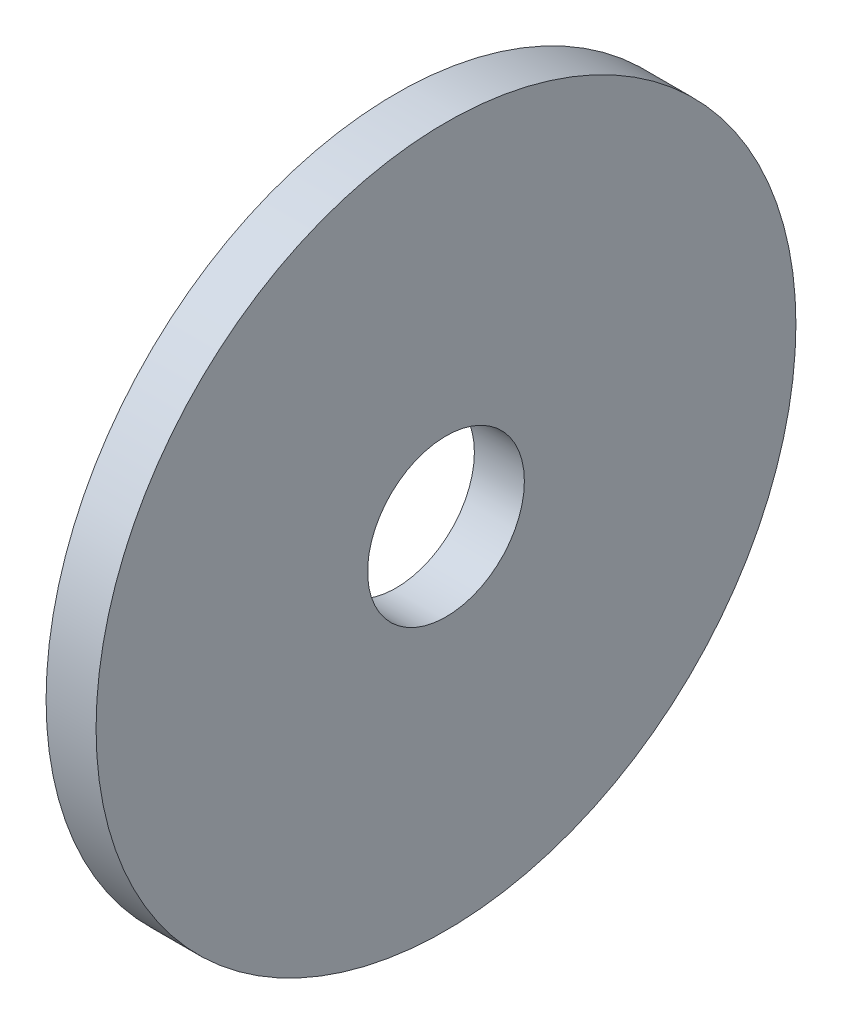
ISO-10303-21;
HEADER;
FILE_DESCRIPTION(('STEP AP214'),'2;1');
FILE_NAME('part.step','',(''),(''),'','','');
FILE_SCHEMA(('AUTOMOTIVE_DESIGN { 1 0 10303 214 1 1 1 1 }'));
ENDSEC;
DATA;
#1=APPLICATION_CONTEXT('core data for automotive mechanical design processes');
#2=APPLICATION_PROTOCOL_DEFINITION('international standard','automotive_design',2000,#1);
#3=PRODUCT_CONTEXT('',#1,'mechanical');
#4=PRODUCT('Part','Part','',(#3));
#5=PRODUCT_RELATED_PRODUCT_CATEGORY('part','',(#4));
#6=PRODUCT_DEFINITION_FORMATION('','',#4);
#7=PRODUCT_DEFINITION_CONTEXT('part definition',#1,'design');
#8=PRODUCT_DEFINITION('design','',#6,#7);
#9=PRODUCT_DEFINITION_SHAPE('','',#8);
#10=(LENGTH_UNIT() NAMED_UNIT(*) SI_UNIT(.MILLI.,.METRE.));
#11=(NAMED_UNIT(*) PLANE_ANGLE_UNIT() SI_UNIT($,.RADIAN.));
#12=(NAMED_UNIT(*) SI_UNIT($,.STERADIAN.) SOLID_ANGLE_UNIT());
#13=UNCERTAINTY_MEASURE_WITH_UNIT(LENGTH_MEASURE(1.E-05),#10,'distance_accuracy_value','');
#14=(GEOMETRIC_REPRESENTATION_CONTEXT(3) GLOBAL_UNCERTAINTY_ASSIGNED_CONTEXT((#13)) GLOBAL_UNIT_ASSIGNED_CONTEXT((#10,
#11,#12)) REPRESENTATION_CONTEXT('',''));
#15=CARTESIAN_POINT('',(0.,0.,0.));
#16=DIRECTION('',(0.,0.,1.));
#17=DIRECTION('',(1.,0.,0.));
#18=AXIS2_PLACEMENT_3D('',#15,#16,#17);
#19=CARTESIAN_POINT('',(1.5875,0.,0.));
#20=DIRECTION('',(-1.,0.,0.));
#21=DIRECTION('',(0.,0.,1.));
#22=AXIS2_PLACEMENT_3D('',#19,#20,#21);
#23=CYLINDRICAL_SURFACE('',#22,11.1125);
#24=CARTESIAN_POINT('',(1.5875,0.,0.));
#25=DIRECTION('',(1.,0.,0.));
#26=DIRECTION('',(0.,0.,-1.));
#27=AXIS2_PLACEMENT_3D('',#24,#25,#26);
#28=CIRCLE('',#27,11.1125);
#29=CARTESIAN_POINT('',(1.5875,0.,-11.1125));
#30=VERTEX_POINT('',#29);
#31=EDGE_CURVE('E10',#30,#30,#28,.T.);
#32=ORIENTED_EDGE('',*,*,#31,.F.);
#33=EDGE_LOOP('',(#32));
#34=FACE_BOUND('',#33,.T.);
#35=CARTESIAN_POINT('',(0.,0.,0.));
#36=DIRECTION('',(1.,0.,0.));
#37=DIRECTION('',(0.,0.,-1.));
#38=AXIS2_PLACEMENT_3D('',#35,#36,#37);
#39=CIRCLE('',#38,11.1125);
#40=CARTESIAN_POINT('',(0.,0.,-11.1125));
#41=VERTEX_POINT('',#40);
#42=EDGE_CURVE('E33',#41,#41,#39,.T.);
#43=ORIENTED_EDGE('',*,*,#42,.T.);
#44=EDGE_LOOP('',(#43));
#45=FACE_BOUND('',#44,.T.);
#46=ADVANCED_FACE('F30',(#34,#45),#23,.T.);
#47=CARTESIAN_POINT('',(1.5875,0.,0.));
#48=DIRECTION('',(1.,0.,0.));
#49=DIRECTION('',(0.,0.,-1.));
#50=AXIS2_PLACEMENT_3D('',#47,#48,#49);
#51=PLANE('',#50);
#52=CARTESIAN_POINT('',(1.5875,0.,0.));
#53=DIRECTION('',(1.,0.,0.));
#54=DIRECTION('',(0.,0.,-1.));
#55=AXIS2_PLACEMENT_3D('',#52,#53,#54);
#56=CIRCLE('',#55,2.48919999999999);
#57=CARTESIAN_POINT('',(1.5875,0.,-2.48919999999999));
#58=VERTEX_POINT('',#57);
#59=EDGE_CURVE('E44',#58,#58,#56,.T.);
#60=ORIENTED_EDGE('',*,*,#59,.F.);
#61=EDGE_LOOP('',(#60));
#62=FACE_BOUND('',#61,.T.);
#63=ORIENTED_EDGE('',*,*,#31,.T.);
#64=EDGE_LOOP('',(#63));
#65=FACE_BOUND('',#64,.T.);
#66=ADVANCED_FACE('F51',(#62,#65),#51,.T.);
#67=CARTESIAN_POINT('',(0.,0.,0.));
#68=DIRECTION('',(1.,0.,0.));
#69=DIRECTION('',(0.,0.,-1.));
#70=AXIS2_PLACEMENT_3D('',#67,#68,#69);
#71=PLANE('',#70);
#72=CARTESIAN_POINT('',(0.,0.,0.));
#73=DIRECTION('',(1.,0.,0.));
#74=DIRECTION('',(0.,0.,-1.));
#75=AXIS2_PLACEMENT_3D('',#72,#73,#74);
#76=CIRCLE('',#75,2.48919999999999);
#77=CARTESIAN_POINT('',(0.,0.,-2.48919999999999));
#78=VERTEX_POINT('',#77);
#79=EDGE_CURVE('E40',#78,#78,#76,.T.);
#80=ORIENTED_EDGE('',*,*,#79,.T.);
#81=EDGE_LOOP('',(#80));
#82=FACE_BOUND('',#81,.T.);
#83=ORIENTED_EDGE('',*,*,#42,.F.);
#84=EDGE_LOOP('',(#83));
#85=FACE_BOUND('',#84,.T.);
#86=ADVANCED_FACE('F53',(#82,#85),#71,.F.);
#87=CARTESIAN_POINT('',(1.5875,0.,0.));
#88=DIRECTION('',(1.,0.,0.));
#89=DIRECTION('',(0.,0.,-1.));
#90=AXIS2_PLACEMENT_3D('',#87,#88,#89);
#91=CYLINDRICAL_SURFACE('',#90,2.48919999999999);
#92=ORIENTED_EDGE('',*,*,#59,.T.);
#93=EDGE_LOOP('',(#92));
#94=FACE_BOUND('',#93,.T.);
#95=ORIENTED_EDGE('',*,*,#79,.F.);
#96=EDGE_LOOP('',(#95));
#97=FACE_BOUND('',#96,.T.);
#98=ADVANCED_FACE('F48',(#94,#97),#91,.F.);
#99=CLOSED_SHELL('',(#46,#66,#86,#98));
#100=MANIFOLD_SOLID_BREP('B2',#99);
#101=ADVANCED_BREP_SHAPE_REPRESENTATION('',(#18,#100),#14);
#102=SHAPE_DEFINITION_REPRESENTATION(#9,#101);
ENDSEC;
END-ISO-10303-21;
